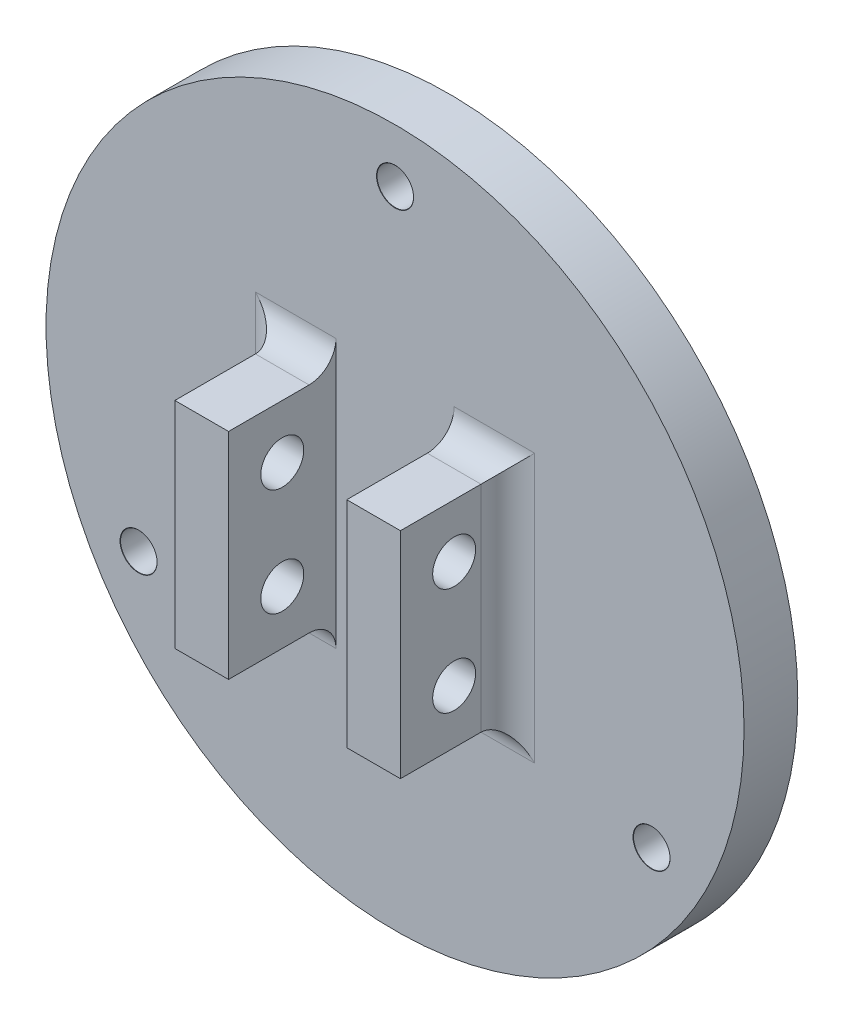
ISO-10303-21;
HEADER;
FILE_DESCRIPTION(('STEP AP214'),'2;1');
FILE_NAME('part.step','',(''),(''),'','','');
FILE_SCHEMA(('AUTOMOTIVE_DESIGN { 1 0 10303 214 1 1 1 1 }'));
ENDSEC;
DATA;
#1=APPLICATION_CONTEXT('core data for automotive mechanical design processes');
#2=APPLICATION_PROTOCOL_DEFINITION('international standard','automotive_design',2000,#1);
#3=PRODUCT_CONTEXT('',#1,'mechanical');
#4=PRODUCT('Part','Part','',(#3));
#5=PRODUCT_RELATED_PRODUCT_CATEGORY('part','',(#4));
#6=PRODUCT_DEFINITION_FORMATION('','',#4);
#7=PRODUCT_DEFINITION_CONTEXT('part definition',#1,'design');
#8=PRODUCT_DEFINITION('design','',#6,#7);
#9=PRODUCT_DEFINITION_SHAPE('','',#8);
#10=(LENGTH_UNIT() NAMED_UNIT(*) SI_UNIT(.MILLI.,.METRE.));
#11=(NAMED_UNIT(*) PLANE_ANGLE_UNIT() SI_UNIT($,.RADIAN.));
#12=(NAMED_UNIT(*) SI_UNIT($,.STERADIAN.) SOLID_ANGLE_UNIT());
#13=UNCERTAINTY_MEASURE_WITH_UNIT(LENGTH_MEASURE(1.E-05),#10,'distance_accuracy_value','');
#14=(GEOMETRIC_REPRESENTATION_CONTEXT(3) GLOBAL_UNCERTAINTY_ASSIGNED_CONTEXT((#13)) GLOBAL_UNIT_ASSIGNED_CONTEXT((#10,
#11,#12)) REPRESENTATION_CONTEXT('',''));
#15=CARTESIAN_POINT('',(0.,0.,0.));
#16=DIRECTION('',(0.,0.,1.));
#17=DIRECTION('',(1.,0.,0.));
#18=AXIS2_PLACEMENT_3D('',#15,#16,#17);
#19=CARTESIAN_POINT('',(0.,0.,5.));
#20=DIRECTION('',(0.,0.,1.));
#21=DIRECTION('',(1.,0.,0.));
#22=AXIS2_PLACEMENT_3D('',#19,#20,#21);
#23=PLANE('',#22);
#24=CARTESIAN_POINT('',(0.,0.,5.));
#25=DIRECTION('',(0.,0.,1.));
#26=DIRECTION('',(1.,0.,0.));
#27=AXIS2_PLACEMENT_3D('',#24,#25,#26);
#28=CIRCLE('',#27,1.7);
#29=CARTESIAN_POINT('',(1.7,0.,5.));
#30=VERTEX_POINT('',#29);
#31=EDGE_CURVE('E211',#30,#30,#28,.T.);
#32=ORIENTED_EDGE('',*,*,#31,.F.);
#33=EDGE_LOOP('',(#32));
#34=FACE_BOUND('',#33,.T.);
#35=CARTESIAN_POINT('',(23.8829807765439,-13.8665361411643,5.));
#36=DIRECTION('',(0.,0.,1.));
#37=DIRECTION('',(1.,0.,0.));
#38=AXIS2_PLACEMENT_3D('',#35,#36,#37);
#39=CIRCLE('',#38,1.725);
#40=CARTESIAN_POINT('',(25.6079807765439,-13.8665361411643,5.));
#41=VERTEX_POINT('',#40);
#42=EDGE_CURVE('E178',#41,#41,#39,.T.);
#43=ORIENTED_EDGE('',*,*,#42,.F.);
#44=EDGE_LOOP('',(#43));
#45=FACE_BOUND('',#44,.T.);
#46=CARTESIAN_POINT('',(-23.8829807765437,-13.8665361411647,5.));
#47=DIRECTION('',(0.,0.,1.));
#48=DIRECTION('',(1.,0.,0.));
#49=AXIS2_PLACEMENT_3D('',#46,#47,#48);
#50=CIRCLE('',#49,1.725);
#51=CARTESIAN_POINT('',(-22.1579807765437,-13.8665361411647,5.));
#52=VERTEX_POINT('',#51);
#53=EDGE_CURVE('E187',#52,#52,#50,.T.);
#54=ORIENTED_EDGE('',*,*,#53,.F.);
#55=EDGE_LOOP('',(#54));
#56=FACE_BOUND('',#55,.T.);
#57=CARTESIAN_POINT('',(0.,27.5,5.));
#58=DIRECTION('',(0.,0.,1.));
#59=DIRECTION('',(1.,0.,0.));
#60=AXIS2_PLACEMENT_3D('',#57,#58,#59);
#61=CIRCLE('',#60,1.725);
#62=CARTESIAN_POINT('',(1.725,27.5,5.));
#63=VERTEX_POINT('',#62);
#64=EDGE_CURVE('E196',#63,#63,#61,.T.);
#65=ORIENTED_EDGE('',*,*,#64,.F.);
#66=EDGE_LOOP('',(#65));
#67=FACE_BOUND('',#66,.T.);
#68=CARTESIAN_POINT('',(0.,0.,5.));
#69=DIRECTION('',(0.,0.,1.));
#70=DIRECTION('',(1.,0.,0.));
#71=AXIS2_PLACEMENT_3D('',#68,#69,#70);
#72=CIRCLE('',#71,32.5);
#73=CARTESIAN_POINT('',(32.5,0.,5.));
#74=VERTEX_POINT('',#73);
#75=EDGE_CURVE('E206',#74,#74,#72,.T.);
#76=ORIENTED_EDGE('',*,*,#75,.T.);
#77=EDGE_LOOP('',(#76));
#78=FACE_BOUND('',#77,.T.);
#79=DIRECTION('',(0.,1.,0.));
#80=VECTOR('',#79,1.);
#81=CARTESIAN_POINT('',(-5.50332787435963,-10.,5.));
#82=LINE('',#81,#80);
#83=CARTESIAN_POINT('',(-5.50332787435963,-12.5,5.));
#84=VERTEX_POINT('',#83);
#85=CARTESIAN_POINT('',(-5.50332787435963,12.5,5.));
#86=VERTEX_POINT('',#85);
#87=EDGE_CURVE('E151',#84,#86,#82,.T.);
#88=ORIENTED_EDGE('',*,*,#87,.F.);
#89=DIRECTION('',(1.,0.,0.));
#90=VECTOR('',#89,1.);
#91=CARTESIAN_POINT('',(0.,-12.5,5.));
#92=LINE('',#91,#90);
#93=CARTESIAN_POINT('',(-13.0033278743596,-12.5,5.));
#94=VERTEX_POINT('',#93);
#95=EDGE_CURVE('E242',#84,#94,#92,.F.);
#96=ORIENTED_EDGE('',*,*,#95,.T.);
#97=DIRECTION('',(0.,-1.,0.));
#98=VECTOR('',#97,1.);
#99=CARTESIAN_POINT('',(-13.0033278743596,0.,5.));
#100=LINE('',#99,#98);
#101=CARTESIAN_POINT('',(-13.0033278743596,12.5,5.));
#102=VERTEX_POINT('',#101);
#103=EDGE_CURVE('E226',#94,#102,#100,.F.);
#104=ORIENTED_EDGE('',*,*,#103,.T.);
#105=DIRECTION('',(-1.,0.,0.));
#106=VECTOR('',#105,1.);
#107=CARTESIAN_POINT('',(0.,12.5,5.));
#108=LINE('',#107,#106);
#109=EDGE_CURVE('E236',#102,#86,#108,.F.);
#110=ORIENTED_EDGE('',*,*,#109,.T.);
#111=EDGE_LOOP('',(#88,#96,#104,#110));
#112=FACE_BOUND('',#111,.T.);
#113=DIRECTION('',(0.,1.,0.));
#114=VECTOR('',#113,1.);
#115=CARTESIAN_POINT('',(13.0033278743596,0.,5.));
#116=LINE('',#115,#114);
#117=CARTESIAN_POINT('',(13.0033278743596,12.5,5.));
#118=VERTEX_POINT('',#117);
#119=CARTESIAN_POINT('',(13.0033278743596,-12.5,5.));
#120=VERTEX_POINT('',#119);
#121=EDGE_CURVE('E228',#118,#120,#116,.F.);
#122=ORIENTED_EDGE('',*,*,#121,.T.);
#123=DIRECTION('',(1.,0.,0.));
#124=VECTOR('',#123,1.);
#125=CARTESIAN_POINT('',(0.,-12.5,5.));
#126=LINE('',#125,#124);
#127=CARTESIAN_POINT('',(5.50332787435963,-12.5,5.));
#128=VERTEX_POINT('',#127);
#129=EDGE_CURVE('E245',#120,#128,#126,.F.);
#130=ORIENTED_EDGE('',*,*,#129,.T.);
#131=DIRECTION('',(0.,-1.,0.));
#132=VECTOR('',#131,1.);
#133=CARTESIAN_POINT('',(5.50332787435963,-10.,5.));
#134=LINE('',#133,#132);
#135=CARTESIAN_POINT('',(5.50332787435963,12.5,5.));
#136=VERTEX_POINT('',#135);
#137=EDGE_CURVE('E145',#136,#128,#134,.T.);
#138=ORIENTED_EDGE('',*,*,#137,.F.);
#139=DIRECTION('',(-1.,0.,0.));
#140=VECTOR('',#139,1.);
#141=CARTESIAN_POINT('',(0.,12.5,5.));
#142=LINE('',#141,#140);
#143=EDGE_CURVE('E239',#136,#118,#142,.F.);
#144=ORIENTED_EDGE('',*,*,#143,.T.);
#145=EDGE_LOOP('',(#122,#130,#138,#144));
#146=FACE_BOUND('',#145,.T.);
#147=ADVANCED_FACE('F36',(#34,#45,#56,#67,#78,#112,#146),#23,.T.);
#148=CARTESIAN_POINT('',(0.,0.,5.));
#149=DIRECTION('',(0.,0.,-1.));
#150=DIRECTION('',(-1.,0.,0.));
#151=AXIS2_PLACEMENT_3D('',#148,#149,#150);
#152=CYLINDRICAL_SURFACE('',#151,32.5);
#153=ORIENTED_EDGE('',*,*,#75,.F.);
#154=EDGE_LOOP('',(#153));
#155=FACE_BOUND('',#154,.T.);
#156=CARTESIAN_POINT('',(0.,0.,0.));
#157=DIRECTION('',(0.,0.,1.));
#158=DIRECTION('',(1.,0.,0.));
#159=AXIS2_PLACEMENT_3D('',#156,#157,#158);
#160=CIRCLE('',#159,32.5);
#161=CARTESIAN_POINT('',(32.5,0.,0.));
#162=VERTEX_POINT('',#161);
#163=EDGE_CURVE('E205',#162,#162,#160,.T.);
#164=ORIENTED_EDGE('',*,*,#163,.T.);
#165=EDGE_LOOP('',(#164));
#166=FACE_BOUND('',#165,.T.);
#167=ADVANCED_FACE('F309',(#155,#166),#152,.T.);
#168=CARTESIAN_POINT('',(0.,0.,0.));
#169=DIRECTION('',(0.,0.,1.));
#170=DIRECTION('',(1.,0.,0.));
#171=AXIS2_PLACEMENT_3D('',#168,#169,#170);
#172=PLANE('',#171);
#173=CARTESIAN_POINT('',(0.,0.,0.));
#174=DIRECTION('',(0.,0.,-1.));
#175=DIRECTION('',(-1.,0.,0.));
#176=AXIS2_PLACEMENT_3D('',#173,#174,#175);
#177=CIRCLE('',#176,3.25);
#178=CARTESIAN_POINT('',(-3.25,0.,0.));
#179=VERTEX_POINT('',#178);
#180=EDGE_CURVE('E607',#179,#179,#177,.T.);
#181=ORIENTED_EDGE('',*,*,#180,.F.);
#182=EDGE_LOOP('',(#181));
#183=FACE_BOUND('',#182,.T.);
#184=CARTESIAN_POINT('',(23.8829807765439,-13.8665361411643,0.));
#185=DIRECTION('',(0.,0.,1.));
#186=DIRECTION('',(1.,0.,0.));
#187=AXIS2_PLACEMENT_3D('',#184,#185,#186);
#188=CIRCLE('',#187,1.7);
#189=CARTESIAN_POINT('',(25.5829807765439,-13.8665361411643,0.));
#190=VERTEX_POINT('',#189);
#191=EDGE_CURVE('E184',#190,#190,#188,.T.);
#192=ORIENTED_EDGE('',*,*,#191,.T.);
#193=EDGE_LOOP('',(#192));
#194=FACE_BOUND('',#193,.T.);
#195=CARTESIAN_POINT('',(-23.8829807765437,-13.8665361411647,0.));
#196=DIRECTION('',(0.,0.,1.));
#197=DIRECTION('',(1.,0.,0.));
#198=AXIS2_PLACEMENT_3D('',#195,#196,#197);
#199=CIRCLE('',#198,1.7);
#200=CARTESIAN_POINT('',(-22.1829807765437,-13.8665361411647,0.));
#201=VERTEX_POINT('',#200);
#202=EDGE_CURVE('E193',#201,#201,#199,.T.);
#203=ORIENTED_EDGE('',*,*,#202,.T.);
#204=EDGE_LOOP('',(#203));
#205=FACE_BOUND('',#204,.T.);
#206=CARTESIAN_POINT('',(0.,27.5,0.));
#207=DIRECTION('',(0.,0.,1.));
#208=DIRECTION('',(1.,0.,0.));
#209=AXIS2_PLACEMENT_3D('',#206,#207,#208);
#210=CIRCLE('',#209,1.7);
#211=CARTESIAN_POINT('',(1.7,27.5,0.));
#212=VERTEX_POINT('',#211);
#213=EDGE_CURVE('E202',#212,#212,#210,.T.);
#214=ORIENTED_EDGE('',*,*,#213,.T.);
#215=EDGE_LOOP('',(#214));
#216=FACE_BOUND('',#215,.T.);
#217=ORIENTED_EDGE('',*,*,#163,.F.);
#218=EDGE_LOOP('',(#217));
#219=FACE_BOUND('',#218,.T.);
#220=ADVANCED_FACE('F315',(#183,#194,#205,#216,#219),#172,.F.);
#221=CARTESIAN_POINT('',(0.,27.5,5.));
#222=DIRECTION('',(0.,0.,1.));
#223=DIRECTION('',(1.,0.,0.));
#224=AXIS2_PLACEMENT_3D('',#221,#222,#223);
#225=CYLINDRICAL_SURFACE('',#224,1.7);
#226=ORIENTED_EDGE('',*,*,#213,.F.);
#227=EDGE_LOOP('',(#226));
#228=FACE_BOUND('',#227,.T.);
#229=CARTESIAN_POINT('',(0.,27.5,4.97902250922057));
#230=DIRECTION('',(0.,0.,1.));
#231=DIRECTION('',(1.,0.,0.));
#232=AXIS2_PLACEMENT_3D('',#229,#230,#231);
#233=CIRCLE('',#232,1.7);
#234=CARTESIAN_POINT('',(1.7,27.5,4.97902250922057));
#235=VERTEX_POINT('',#234);
#236=EDGE_CURVE('E199',#235,#235,#233,.T.);
#237=ORIENTED_EDGE('',*,*,#236,.T.);
#238=EDGE_LOOP('',(#237));
#239=FACE_BOUND('',#238,.T.);
#240=ADVANCED_FACE('F322',(#228,#239),#225,.F.);
#241=CARTESIAN_POINT('',(0.,27.5,5.));
#242=DIRECTION('',(0.,0.,1.));
#243=DIRECTION('',(1.,0.,0.));
#244=AXIS2_PLACEMENT_3D('',#241,#242,#243);
#245=CONICAL_SURFACE('',#244,1.725,0.872664625997142);
#246=ORIENTED_EDGE('',*,*,#236,.F.);
#247=EDGE_LOOP('',(#246));
#248=FACE_BOUND('',#247,.T.);
#249=ORIENTED_EDGE('',*,*,#64,.T.);
#250=EDGE_LOOP('',(#249));
#251=FACE_BOUND('',#250,.T.);
#252=ADVANCED_FACE('F507',(#248,#251),#245,.F.);
#253=CARTESIAN_POINT('',(-23.8829807765437,-13.8665361411647,5.));
#254=DIRECTION('',(0.,0.,1.));
#255=DIRECTION('',(1.,0.,0.));
#256=AXIS2_PLACEMENT_3D('',#253,#254,#255);
#257=CYLINDRICAL_SURFACE('',#256,1.7);
#258=ORIENTED_EDGE('',*,*,#202,.F.);
#259=EDGE_LOOP('',(#258));
#260=FACE_BOUND('',#259,.T.);
#261=CARTESIAN_POINT('',(-23.8829807765437,-13.8665361411647,4.97902250922057));
#262=DIRECTION('',(0.,0.,1.));
#263=DIRECTION('',(1.,0.,0.));
#264=AXIS2_PLACEMENT_3D('',#261,#262,#263);
#265=CIRCLE('',#264,1.7);
#266=CARTESIAN_POINT('',(-22.1829807765437,-13.8665361411647,4.97902250922057));
#267=VERTEX_POINT('',#266);
#268=EDGE_CURVE('E190',#267,#267,#265,.T.);
#269=ORIENTED_EDGE('',*,*,#268,.T.);
#270=EDGE_LOOP('',(#269));
#271=FACE_BOUND('',#270,.T.);
#272=ADVANCED_FACE('F513',(#260,#271),#257,.F.);
#273=CARTESIAN_POINT('',(-23.8829807765437,-13.8665361411647,5.));
#274=DIRECTION('',(0.,0.,1.));
#275=DIRECTION('',(1.,0.,0.));
#276=AXIS2_PLACEMENT_3D('',#273,#274,#275);
#277=CONICAL_SURFACE('',#276,1.725,0.872664625997138);
#278=ORIENTED_EDGE('',*,*,#268,.F.);
#279=EDGE_LOOP('',(#278));
#280=FACE_BOUND('',#279,.T.);
#281=ORIENTED_EDGE('',*,*,#53,.T.);
#282=EDGE_LOOP('',(#281));
#283=FACE_BOUND('',#282,.T.);
#284=ADVANCED_FACE('F520',(#280,#283),#277,.F.);
#285=CARTESIAN_POINT('',(23.8829807765439,-13.8665361411643,5.));
#286=DIRECTION('',(0.,0.,1.));
#287=DIRECTION('',(1.,0.,0.));
#288=AXIS2_PLACEMENT_3D('',#285,#286,#287);
#289=CYLINDRICAL_SURFACE('',#288,1.7);
#290=ORIENTED_EDGE('',*,*,#191,.F.);
#291=EDGE_LOOP('',(#290));
#292=FACE_BOUND('',#291,.T.);
#293=CARTESIAN_POINT('',(23.8829807765439,-13.8665361411643,4.97902250922057));
#294=DIRECTION('',(0.,0.,1.));
#295=DIRECTION('',(1.,0.,0.));
#296=AXIS2_PLACEMENT_3D('',#293,#294,#295);
#297=CIRCLE('',#296,1.7);
#298=CARTESIAN_POINT('',(25.5829807765439,-13.8665361411643,4.97902250922057));
#299=VERTEX_POINT('',#298);
#300=EDGE_CURVE('E181',#299,#299,#297,.T.);
#301=ORIENTED_EDGE('',*,*,#300,.T.);
#302=EDGE_LOOP('',(#301));
#303=FACE_BOUND('',#302,.T.);
#304=ADVANCED_FACE('F528',(#292,#303),#289,.F.);
#305=CARTESIAN_POINT('',(23.8829807765439,-13.8665361411643,5.));
#306=DIRECTION('',(0.,0.,1.));
#307=DIRECTION('',(1.,0.,0.));
#308=AXIS2_PLACEMENT_3D('',#305,#306,#307);
#309=CONICAL_SURFACE('',#308,1.725,0.872664625997138);
#310=ORIENTED_EDGE('',*,*,#300,.F.);
#311=EDGE_LOOP('',(#310));
#312=FACE_BOUND('',#311,.T.);
#313=ORIENTED_EDGE('',*,*,#42,.T.);
#314=EDGE_LOOP('',(#313));
#315=FACE_BOUND('',#314,.T.);
#316=ADVANCED_FACE('F536',(#312,#315),#309,.F.);
#317=CARTESIAN_POINT('',(-10.5033278743596,-10.,15.));
#318=DIRECTION('',(1.,0.,0.));
#319=DIRECTION('',(0.,0.,-1.));
#320=AXIS2_PLACEMENT_3D('',#317,#318,#319);
#321=PLANE('',#320);
#322=CARTESIAN_POINT('',(-10.5033278743596,5.,10.));
#323=DIRECTION('',(-1.,0.,0.));
#324=DIRECTION('',(0.,0.,1.));
#325=AXIS2_PLACEMENT_3D('',#322,#323,#324);
#326=CIRCLE('',#325,1.99999999999999);
#327=CARTESIAN_POINT('',(-10.5033278743596,5.,12.));
#328=VERTEX_POINT('',#327);
#329=EDGE_CURVE('E224',#328,#328,#326,.T.);
#330=ORIENTED_EDGE('',*,*,#329,.F.);
#331=EDGE_LOOP('',(#330));
#332=FACE_BOUND('',#331,.T.);
#333=CARTESIAN_POINT('',(-10.5033278743596,-5.,10.));
#334=DIRECTION('',(-1.,0.,0.));
#335=DIRECTION('',(0.,0.,1.));
#336=AXIS2_PLACEMENT_3D('',#333,#334,#335);
#337=CIRCLE('',#336,1.99999999999999);
#338=CARTESIAN_POINT('',(-10.5033278743596,-5.,12.));
#339=VERTEX_POINT('',#338);
#340=EDGE_CURVE('E219',#339,#339,#337,.T.);
#341=ORIENTED_EDGE('',*,*,#340,.F.);
#342=EDGE_LOOP('',(#341));
#343=FACE_BOUND('',#342,.T.);
#344=DIRECTION('',(0.,0.,-1.));
#345=VECTOR('',#344,1.);
#346=CARTESIAN_POINT('',(-10.5033278743596,10.,15.));
#347=LINE('',#346,#345);
#348=CARTESIAN_POINT('',(-10.5033278743596,10.,15.));
#349=VERTEX_POINT('',#348);
#350=CARTESIAN_POINT('',(-10.5033278743596,10.,7.5));
#351=VERTEX_POINT('',#350);
#352=EDGE_CURVE('E166',#349,#351,#347,.T.);
#353=ORIENTED_EDGE('',*,*,#352,.T.);
#354=DIRECTION('',(0.,-1.,0.));
#355=VECTOR('',#354,1.);
#356=CARTESIAN_POINT('',(-10.5033278743596,-10.,7.5));
#357=LINE('',#356,#355);
#358=CARTESIAN_POINT('',(-10.5033278743596,-10.,7.5));
#359=VERTEX_POINT('',#358);
#360=EDGE_CURVE('E230',#351,#359,#357,.T.);
#361=ORIENTED_EDGE('',*,*,#360,.T.);
#362=DIRECTION('',(0.,0.,-1.));
#363=VECTOR('',#362,1.);
#364=CARTESIAN_POINT('',(-10.5033278743596,-10.,15.));
#365=LINE('',#364,#363);
#366=CARTESIAN_POINT('',(-10.5033278743596,-10.,15.));
#367=VERTEX_POINT('',#366);
#368=EDGE_CURVE('E175',#367,#359,#365,.T.);
#369=ORIENTED_EDGE('',*,*,#368,.F.);
#370=DIRECTION('',(0.,-1.,0.));
#371=VECTOR('',#370,1.);
#372=CARTESIAN_POINT('',(-10.5033278743596,-10.,15.));
#373=LINE('',#372,#371);
#374=EDGE_CURVE('E153',#349,#367,#373,.T.);
#375=ORIENTED_EDGE('',*,*,#374,.F.);
#376=EDGE_LOOP('',(#353,#361,#369,#375));
#377=FACE_BOUND('',#376,.T.);
#378=ADVANCED_FACE('F284',(#332,#343,#377),#321,.F.);
#379=CARTESIAN_POINT('',(-10.5033278743596,-10.,15.));
#380=DIRECTION('',(0.,1.,0.));
#381=DIRECTION('',(0.,0.,1.));
#382=AXIS2_PLACEMENT_3D('',#379,#380,#381);
#383=PLANE('',#382);
#384=ORIENTED_EDGE('',*,*,#368,.T.);
#385=DIRECTION('',(1.,0.,0.));
#386=VECTOR('',#385,1.);
#387=CARTESIAN_POINT('',(-10.5033278743596,-10.,7.5));
#388=LINE('',#387,#386);
#389=CARTESIAN_POINT('',(-5.50332787435963,-10.,7.5));
#390=VERTEX_POINT('',#389);
#391=EDGE_CURVE('E248',#359,#390,#388,.T.);
#392=ORIENTED_EDGE('',*,*,#391,.T.);
#393=DIRECTION('',(0.,0.,-1.));
#394=VECTOR('',#393,1.);
#395=CARTESIAN_POINT('',(-5.50332787435963,-10.,15.));
#396=LINE('',#395,#394);
#397=CARTESIAN_POINT('',(-5.50332787435963,-10.,15.));
#398=VERTEX_POINT('',#397);
#399=EDGE_CURVE('E172',#398,#390,#396,.T.);
#400=ORIENTED_EDGE('',*,*,#399,.F.);
#401=DIRECTION('',(1.,0.,0.));
#402=VECTOR('',#401,1.);
#403=CARTESIAN_POINT('',(-10.5033278743596,-10.,15.));
#404=LINE('',#403,#402);
#405=EDGE_CURVE('E161',#367,#398,#404,.T.);
#406=ORIENTED_EDGE('',*,*,#405,.F.);
#407=EDGE_LOOP('',(#384,#392,#400,#406));
#408=FACE_BOUND('',#407,.T.);
#409=ADVANCED_FACE('F288',(#408),#383,.F.);
#410=CARTESIAN_POINT('',(-5.50332787435963,-10.,15.));
#411=DIRECTION('',(-1.,0.,0.));
#412=DIRECTION('',(0.,0.,1.));
#413=AXIS2_PLACEMENT_3D('',#410,#411,#412);
#414=PLANE('',#413);
#415=CARTESIAN_POINT('',(-5.50332787435963,5.,10.));
#416=DIRECTION('',(-1.,0.,0.));
#417=DIRECTION('',(0.,0.,1.));
#418=AXIS2_PLACEMENT_3D('',#415,#416,#417);
#419=CIRCLE('',#418,1.99999999999999);
#420=CARTESIAN_POINT('',(-5.50332787435963,5.,12.));
#421=VERTEX_POINT('',#420);
#422=EDGE_CURVE('E223',#421,#421,#419,.T.);
#423=ORIENTED_EDGE('',*,*,#422,.T.);
#424=EDGE_LOOP('',(#423));
#425=FACE_BOUND('',#424,.T.);
#426=CARTESIAN_POINT('',(-5.50332787435963,-5.,10.));
#427=DIRECTION('',(-1.,0.,0.));
#428=DIRECTION('',(0.,0.,1.));
#429=AXIS2_PLACEMENT_3D('',#426,#427,#428);
#430=CIRCLE('',#429,1.99999999999999);
#431=CARTESIAN_POINT('',(-5.50332787435963,-5.,12.));
#432=VERTEX_POINT('',#431);
#433=EDGE_CURVE('E604',#432,#432,#430,.T.);
#434=ORIENTED_EDGE('',*,*,#433,.T.);
#435=EDGE_LOOP('',(#434));
#436=FACE_BOUND('',#435,.T.);
#437=ORIENTED_EDGE('',*,*,#87,.T.);
#438=CARTESIAN_POINT('',(-5.50332787435963,12.5,7.5));
#439=DIRECTION('',(-1.,0.,0.));
#440=DIRECTION('',(0.,0.,1.));
#441=AXIS2_PLACEMENT_3D('',#438,#439,#440);
#442=CIRCLE('',#441,2.5);
#443=CARTESIAN_POINT('',(-5.50332787435963,10.,7.5));
#444=VERTEX_POINT('',#443);
#445=EDGE_CURVE('E11',#86,#444,#442,.T.);
#446=ORIENTED_EDGE('',*,*,#445,.T.);
#447=DIRECTION('',(0.,0.,-1.));
#448=VECTOR('',#447,1.);
#449=CARTESIAN_POINT('',(-5.50332787435963,10.,15.));
#450=LINE('',#449,#448);
#451=CARTESIAN_POINT('',(-5.50332787435963,10.,15.));
#452=VERTEX_POINT('',#451);
#453=EDGE_CURVE('E170',#452,#444,#450,.T.);
#454=ORIENTED_EDGE('',*,*,#453,.F.);
#455=DIRECTION('',(0.,1.,0.));
#456=VECTOR('',#455,1.);
#457=CARTESIAN_POINT('',(-5.50332787435963,-10.,15.));
#458=LINE('',#457,#456);
#459=EDGE_CURVE('E163',#398,#452,#458,.T.);
#460=ORIENTED_EDGE('',*,*,#459,.F.);
#461=ORIENTED_EDGE('',*,*,#399,.T.);
#462=CARTESIAN_POINT('',(-5.50332787435963,-12.5,7.5));
#463=DIRECTION('',(-1.,0.,0.));
#464=DIRECTION('',(0.,0.,1.));
#465=AXIS2_PLACEMENT_3D('',#462,#463,#464);
#466=CIRCLE('',#465,2.5);
#467=EDGE_CURVE('E261',#390,#84,#466,.T.);
#468=ORIENTED_EDGE('',*,*,#467,.T.);
#469=EDGE_LOOP('',(#437,#446,#454,#460,#461,#468));
#470=FACE_BOUND('',#469,.T.);
#471=ADVANCED_FACE('F296',(#425,#436,#470),#414,.F.);
#472=CARTESIAN_POINT('',(-10.5033278743596,10.,15.));
#473=DIRECTION('',(0.,-1.,0.));
#474=DIRECTION('',(0.,0.,-1.));
#475=AXIS2_PLACEMENT_3D('',#472,#473,#474);
#476=PLANE('',#475);
#477=ORIENTED_EDGE('',*,*,#453,.T.);
#478=DIRECTION('',(-1.,0.,0.));
#479=VECTOR('',#478,1.);
#480=CARTESIAN_POINT('',(-10.5033278743596,10.,7.5));
#481=LINE('',#480,#479);
#482=EDGE_CURVE('E253',#444,#351,#481,.T.);
#483=ORIENTED_EDGE('',*,*,#482,.T.);
#484=ORIENTED_EDGE('',*,*,#352,.F.);
#485=DIRECTION('',(-1.,0.,0.));
#486=VECTOR('',#485,1.);
#487=CARTESIAN_POINT('',(-10.5033278743596,10.,15.));
#488=LINE('',#487,#486);
#489=EDGE_CURVE('E165',#452,#349,#488,.T.);
#490=ORIENTED_EDGE('',*,*,#489,.F.);
#491=EDGE_LOOP('',(#477,#483,#484,#490));
#492=FACE_BOUND('',#491,.T.);
#493=ADVANCED_FACE('F295',(#492),#476,.F.);
#494=CARTESIAN_POINT('',(0.,0.,15.));
#495=DIRECTION('',(0.,0.,-1.));
#496=DIRECTION('',(-1.,0.,0.));
#497=AXIS2_PLACEMENT_3D('',#494,#495,#496);
#498=PLANE('',#497);
#499=ORIENTED_EDGE('',*,*,#374,.T.);
#500=ORIENTED_EDGE('',*,*,#405,.T.);
#501=ORIENTED_EDGE('',*,*,#459,.T.);
#502=ORIENTED_EDGE('',*,*,#489,.T.);
#503=EDGE_LOOP('',(#499,#500,#501,#502));
#504=FACE_BOUND('',#503,.T.);
#505=ADVANCED_FACE('F292',(#504),#498,.F.);
#506=CARTESIAN_POINT('',(10.5033278743596,-10.,15.));
#507=DIRECTION('',(-1.,0.,0.));
#508=DIRECTION('',(0.,-1.,0.));
#509=AXIS2_PLACEMENT_3D('',#506,#507,#508);
#510=PLANE('',#509);
#511=CARTESIAN_POINT('',(10.5033278743596,5.,10.));
#512=DIRECTION('',(-1.,0.,0.));
#513=DIRECTION('',(0.,-1.,0.));
#514=AXIS2_PLACEMENT_3D('',#511,#512,#513);
#515=CIRCLE('',#514,1.99999999999999);
#516=CARTESIAN_POINT('',(10.5033278743596,3.00000000000001,10.));
#517=VERTEX_POINT('',#516);
#518=EDGE_CURVE('E596',#517,#517,#515,.T.);
#519=ORIENTED_EDGE('',*,*,#518,.T.);
#520=EDGE_LOOP('',(#519));
#521=FACE_BOUND('',#520,.T.);
#522=CARTESIAN_POINT('',(10.5033278743596,-5.,10.));
#523=DIRECTION('',(-1.,0.,0.));
#524=DIRECTION('',(0.,-1.,0.));
#525=AXIS2_PLACEMENT_3D('',#522,#523,#524);
#526=CIRCLE('',#525,1.99999999999999);
#527=CARTESIAN_POINT('',(10.5033278743596,-6.99999999999999,10.));
#528=VERTEX_POINT('',#527);
#529=EDGE_CURVE('E215',#528,#528,#526,.T.);
#530=ORIENTED_EDGE('',*,*,#529,.T.);
#531=EDGE_LOOP('',(#530));
#532=FACE_BOUND('',#531,.T.);
#533=DIRECTION('',(0.,0.,-1.));
#534=VECTOR('',#533,1.);
#535=CARTESIAN_POINT('',(10.5033278743596,-10.,15.));
#536=LINE('',#535,#534);
#537=CARTESIAN_POINT('',(10.5033278743596,-10.,15.));
#538=VERTEX_POINT('',#537);
#539=CARTESIAN_POINT('',(10.5033278743596,-10.,7.5));
#540=VERTEX_POINT('',#539);
#541=EDGE_CURVE('E353',#538,#540,#536,.T.);
#542=ORIENTED_EDGE('',*,*,#541,.T.);
#543=DIRECTION('',(0.,1.,0.));
#544=VECTOR('',#543,1.);
#545=CARTESIAN_POINT('',(10.5033278743596,-10.,7.5));
#546=LINE('',#545,#544);
#547=CARTESIAN_POINT('',(10.5033278743596,10.,7.5));
#548=VERTEX_POINT('',#547);
#549=EDGE_CURVE('E150',#540,#548,#546,.T.);
#550=ORIENTED_EDGE('',*,*,#549,.T.);
#551=DIRECTION('',(0.,0.,-1.));
#552=VECTOR('',#551,1.);
#553=CARTESIAN_POINT('',(10.5033278743596,10.,15.));
#554=LINE('',#553,#552);
#555=CARTESIAN_POINT('',(10.5033278743596,10.,15.));
#556=VERTEX_POINT('',#555);
#557=EDGE_CURVE('E130',#556,#548,#554,.T.);
#558=ORIENTED_EDGE('',*,*,#557,.F.);
#559=DIRECTION('',(0.,1.,0.));
#560=VECTOR('',#559,1.);
#561=CARTESIAN_POINT('',(10.5033278743596,-10.,15.));
#562=LINE('',#561,#560);
#563=EDGE_CURVE('E136',#538,#556,#562,.T.);
#564=ORIENTED_EDGE('',*,*,#563,.F.);
#565=EDGE_LOOP('',(#542,#550,#558,#564));
#566=FACE_BOUND('',#565,.T.);
#567=ADVANCED_FACE('F148',(#521,#532,#566),#510,.F.);
#568=CARTESIAN_POINT('',(10.5033278743596,10.,15.));
#569=DIRECTION('',(0.,-1.,0.));
#570=DIRECTION('',(0.,0.,-1.));
#571=AXIS2_PLACEMENT_3D('',#568,#569,#570);
#572=PLANE('',#571);
#573=ORIENTED_EDGE('',*,*,#557,.T.);
#574=DIRECTION('',(-1.,0.,0.));
#575=VECTOR('',#574,1.);
#576=CARTESIAN_POINT('',(10.5033278743596,10.,7.5));
#577=LINE('',#576,#575);
#578=CARTESIAN_POINT('',(5.50332787435963,10.,7.5));
#579=VERTEX_POINT('',#578);
#580=EDGE_CURVE('E251',#548,#579,#577,.T.);
#581=ORIENTED_EDGE('',*,*,#580,.T.);
#582=DIRECTION('',(0.,0.,-1.));
#583=VECTOR('',#582,1.);
#584=CARTESIAN_POINT('',(5.50332787435963,10.,15.));
#585=LINE('',#584,#583);
#586=CARTESIAN_POINT('',(5.50332787435963,10.,15.));
#587=VERTEX_POINT('',#586);
#588=EDGE_CURVE('E132',#587,#579,#585,.T.);
#589=ORIENTED_EDGE('',*,*,#588,.F.);
#590=DIRECTION('',(-1.,0.,0.));
#591=VECTOR('',#590,1.);
#592=CARTESIAN_POINT('',(10.5033278743596,10.,15.));
#593=LINE('',#592,#591);
#594=EDGE_CURVE('E126',#556,#587,#593,.T.);
#595=ORIENTED_EDGE('',*,*,#594,.F.);
#596=EDGE_LOOP('',(#573,#581,#589,#595));
#597=FACE_BOUND('',#596,.T.);
#598=ADVANCED_FACE('F128',(#597),#572,.F.);
#599=CARTESIAN_POINT('',(5.50332787435963,-10.,15.));
#600=DIRECTION('',(1.,0.,0.));
#601=DIRECTION('',(0.,1.,0.));
#602=AXIS2_PLACEMENT_3D('',#599,#600,#601);
#603=PLANE('',#602);
#604=CARTESIAN_POINT('',(5.50332787435963,5.,10.));
#605=DIRECTION('',(1.,0.,0.));
#606=DIRECTION('',(0.,1.,0.));
#607=AXIS2_PLACEMENT_3D('',#604,#605,#606);
#608=CIRCLE('',#607,1.99999999999999);
#609=CARTESIAN_POINT('',(5.50332787435963,6.99999999999999,10.));
#610=VERTEX_POINT('',#609);
#611=EDGE_CURVE('E220',#610,#610,#608,.T.);
#612=ORIENTED_EDGE('',*,*,#611,.T.);
#613=EDGE_LOOP('',(#612));
#614=FACE_BOUND('',#613,.T.);
#615=CARTESIAN_POINT('',(5.50332787435963,-5.,10.));
#616=DIRECTION('',(1.,0.,0.));
#617=DIRECTION('',(0.,1.,0.));
#618=AXIS2_PLACEMENT_3D('',#615,#616,#617);
#619=CIRCLE('',#618,1.99999999999999);
#620=CARTESIAN_POINT('',(5.50332787435963,-3.00000000000001,10.));
#621=VERTEX_POINT('',#620);
#622=EDGE_CURVE('E218',#621,#621,#619,.T.);
#623=ORIENTED_EDGE('',*,*,#622,.T.);
#624=EDGE_LOOP('',(#623));
#625=FACE_BOUND('',#624,.T.);
#626=ORIENTED_EDGE('',*,*,#137,.T.);
#627=CARTESIAN_POINT('',(5.50332787435963,-12.5,7.5));
#628=DIRECTION('',(1.,0.,0.));
#629=DIRECTION('',(0.,1.,0.));
#630=AXIS2_PLACEMENT_3D('',#627,#628,#629);
#631=CIRCLE('',#630,2.5);
#632=CARTESIAN_POINT('',(5.50332787435963,-10.,7.5));
#633=VERTEX_POINT('',#632);
#634=EDGE_CURVE('E259',#128,#633,#631,.T.);
#635=ORIENTED_EDGE('',*,*,#634,.T.);
#636=DIRECTION('',(0.,0.,-1.));
#637=VECTOR('',#636,1.);
#638=CARTESIAN_POINT('',(5.50332787435963,-10.,15.));
#639=LINE('',#638,#637);
#640=CARTESIAN_POINT('',(5.50332787435963,-10.,15.));
#641=VERTEX_POINT('',#640);
#642=EDGE_CURVE('E155',#641,#633,#639,.T.);
#643=ORIENTED_EDGE('',*,*,#642,.F.);
#644=DIRECTION('',(0.,-1.,0.));
#645=VECTOR('',#644,1.);
#646=CARTESIAN_POINT('',(5.50332787435963,-10.,15.));
#647=LINE('',#646,#645);
#648=EDGE_CURVE('E135',#587,#641,#647,.T.);
#649=ORIENTED_EDGE('',*,*,#648,.F.);
#650=ORIENTED_EDGE('',*,*,#588,.T.);
#651=CARTESIAN_POINT('',(5.50332787435963,12.5,7.5));
#652=DIRECTION('',(1.,0.,0.));
#653=DIRECTION('',(0.,1.,0.));
#654=AXIS2_PLACEMENT_3D('',#651,#652,#653);
#655=CIRCLE('',#654,2.5);
#656=EDGE_CURVE('E57',#579,#136,#655,.T.);
#657=ORIENTED_EDGE('',*,*,#656,.T.);
#658=EDGE_LOOP('',(#626,#635,#643,#649,#650,#657));
#659=FACE_BOUND('',#658,.T.);
#660=ADVANCED_FACE('F349',(#614,#625,#659),#603,.F.);
#661=CARTESIAN_POINT('',(10.5033278743596,-10.,15.));
#662=DIRECTION('',(0.,1.,0.));
#663=DIRECTION('',(0.,0.,1.));
#664=AXIS2_PLACEMENT_3D('',#661,#662,#663);
#665=PLANE('',#664);
#666=ORIENTED_EDGE('',*,*,#642,.T.);
#667=DIRECTION('',(1.,0.,0.));
#668=VECTOR('',#667,1.);
#669=CARTESIAN_POINT('',(10.5033278743596,-10.,7.5));
#670=LINE('',#669,#668);
#671=EDGE_CURVE('E233',#633,#540,#670,.T.);
#672=ORIENTED_EDGE('',*,*,#671,.T.);
#673=ORIENTED_EDGE('',*,*,#541,.F.);
#674=DIRECTION('',(1.,0.,0.));
#675=VECTOR('',#674,1.);
#676=CARTESIAN_POINT('',(10.5033278743596,-10.,15.));
#677=LINE('',#676,#675);
#678=EDGE_CURVE('E141',#641,#538,#677,.T.);
#679=ORIENTED_EDGE('',*,*,#678,.F.);
#680=EDGE_LOOP('',(#666,#672,#673,#679));
#681=FACE_BOUND('',#680,.T.);
#682=ADVANCED_FACE('F358',(#681),#665,.F.);
#683=CARTESIAN_POINT('',(0.,0.,15.));
#684=DIRECTION('',(0.,0.,1.));
#685=DIRECTION('',(1.,0.,0.));
#686=AXIS2_PLACEMENT_3D('',#683,#684,#685);
#687=PLANE('',#686);
#688=ORIENTED_EDGE('',*,*,#563,.T.);
#689=ORIENTED_EDGE('',*,*,#594,.T.);
#690=ORIENTED_EDGE('',*,*,#648,.T.);
#691=ORIENTED_EDGE('',*,*,#678,.T.);
#692=EDGE_LOOP('',(#688,#689,#690,#691));
#693=FACE_BOUND('',#692,.T.);
#694=ADVANCED_FACE('F139',(#693),#687,.T.);
#695=CARTESIAN_POINT('',(0.,0.,0.));
#696=DIRECTION('',(0.,0.,-1.));
#697=DIRECTION('',(-1.,0.,0.));
#698=AXIS2_PLACEMENT_3D('',#695,#696,#697);
#699=CYLINDRICAL_SURFACE('',#698,1.7);
#700=ORIENTED_EDGE('',*,*,#31,.T.);
#701=EDGE_LOOP('',(#700));
#702=FACE_BOUND('',#701,.T.);
#703=CARTESIAN_POINT('',(0.,0.,3.4));
#704=DIRECTION('',(0.,0.,-1.));
#705=DIRECTION('',(-1.,0.,0.));
#706=AXIS2_PLACEMENT_3D('',#703,#704,#705);
#707=CIRCLE('',#706,1.7);
#708=CARTESIAN_POINT('',(-1.7,0.,3.4));
#709=VERTEX_POINT('',#708);
#710=EDGE_CURVE('E214',#709,#709,#707,.T.);
#711=ORIENTED_EDGE('',*,*,#710,.T.);
#712=EDGE_LOOP('',(#711));
#713=FACE_BOUND('',#712,.T.);
#714=ADVANCED_FACE('F365',(#702,#713),#699,.F.);
#715=CARTESIAN_POINT('',(1.7,0.,3.4));
#716=DIRECTION('',(0.,0.,1.));
#717=DIRECTION('',(1.,0.,0.));
#718=AXIS2_PLACEMENT_3D('',#715,#716,#717);
#719=PLANE('',#718);
#720=ORIENTED_EDGE('',*,*,#710,.F.);
#721=EDGE_LOOP('',(#720));
#722=FACE_BOUND('',#721,.T.);
#723=CARTESIAN_POINT('',(0.,0.,3.4));
#724=DIRECTION('',(0.,0.,-1.));
#725=DIRECTION('',(-1.,0.,0.));
#726=AXIS2_PLACEMENT_3D('',#723,#724,#725);
#727=CIRCLE('',#726,3.25);
#728=CARTESIAN_POINT('',(-3.25,0.,3.4));
#729=VERTEX_POINT('',#728);
#730=EDGE_CURVE('E610',#729,#729,#727,.T.);
#731=ORIENTED_EDGE('',*,*,#730,.T.);
#732=EDGE_LOOP('',(#731));
#733=FACE_BOUND('',#732,.T.);
#734=ADVANCED_FACE('F472',(#722,#733),#719,.F.);
#735=CARTESIAN_POINT('',(0.,0.,0.));
#736=DIRECTION('',(0.,0.,-1.));
#737=DIRECTION('',(-1.,0.,0.));
#738=AXIS2_PLACEMENT_3D('',#735,#736,#737);
#739=CYLINDRICAL_SURFACE('',#738,3.25);
#740=ORIENTED_EDGE('',*,*,#730,.F.);
#741=EDGE_LOOP('',(#740));
#742=FACE_BOUND('',#741,.T.);
#743=ORIENTED_EDGE('',*,*,#180,.T.);
#744=EDGE_LOOP('',(#743));
#745=FACE_BOUND('',#744,.T.);
#746=ADVANCED_FACE('F465',(#742,#745),#739,.F.);
#747=CARTESIAN_POINT('',(-10.5033278743596,-5.,10.));
#748=DIRECTION('',(-1.,0.,0.));
#749=DIRECTION('',(0.,0.,1.));
#750=AXIS2_PLACEMENT_3D('',#747,#748,#749);
#751=CYLINDRICAL_SURFACE('',#750,1.99999999999999);
#752=ORIENTED_EDGE('',*,*,#529,.F.);
#753=EDGE_LOOP('',(#752));
#754=FACE_BOUND('',#753,.T.);
#755=ORIENTED_EDGE('',*,*,#622,.F.);
#756=EDGE_LOOP('',(#755));
#757=FACE_BOUND('',#756,.T.);
#758=ADVANCED_FACE('F457',(#754,#757),#751,.F.);
#759=ORIENTED_EDGE('',*,*,#340,.T.);
#760=EDGE_LOOP('',(#759));
#761=FACE_BOUND('',#760,.T.);
#762=ORIENTED_EDGE('',*,*,#433,.F.);
#763=EDGE_LOOP('',(#762));
#764=FACE_BOUND('',#763,.T.);
#765=ADVANCED_FACE('F450',(#761,#764),#751,.F.);
#766=CARTESIAN_POINT('',(-10.5033278743596,5.,10.));
#767=DIRECTION('',(-1.,0.,0.));
#768=DIRECTION('',(0.,0.,1.));
#769=AXIS2_PLACEMENT_3D('',#766,#767,#768);
#770=CYLINDRICAL_SURFACE('',#769,1.99999999999999);
#771=ORIENTED_EDGE('',*,*,#611,.F.);
#772=EDGE_LOOP('',(#771));
#773=FACE_BOUND('',#772,.T.);
#774=ORIENTED_EDGE('',*,*,#518,.F.);
#775=EDGE_LOOP('',(#774));
#776=FACE_BOUND('',#775,.T.);
#777=ADVANCED_FACE('F443',(#773,#776),#770,.F.);
#778=ORIENTED_EDGE('',*,*,#329,.T.);
#779=EDGE_LOOP('',(#778));
#780=FACE_BOUND('',#779,.T.);
#781=ORIENTED_EDGE('',*,*,#422,.F.);
#782=EDGE_LOOP('',(#781));
#783=FACE_BOUND('',#782,.T.);
#784=ADVANCED_FACE('F330',(#780,#783),#770,.F.);
#785=CARTESIAN_POINT('',(13.0033278743596,-10.,7.5));
#786=DIRECTION('',(0.,1.,0.));
#787=DIRECTION('',(-1.,0.,0.));
#788=AXIS2_PLACEMENT_3D('',#785,#786,#787);
#789=CYLINDRICAL_SURFACE('',#788,2.5);
#790=ORIENTED_EDGE('',*,*,#549,.F.);
#791=CARTESIAN_POINT('',(13.0033278743596,-12.5,7.5));
#792=DIRECTION('',(0.707106781186547,0.707106781186548,0.));
#793=DIRECTION('',(-0.707106781186548,0.707106781186547,0.));
#794=AXIS2_PLACEMENT_3D('',#791,#792,#793);
#795=ELLIPSE('',#794,3.53553390593274,2.5);
#796=EDGE_CURVE('E256',#540,#120,#795,.F.);
#797=ORIENTED_EDGE('',*,*,#796,.T.);
#798=ORIENTED_EDGE('',*,*,#121,.F.);
#799=CARTESIAN_POINT('',(13.0033278743596,12.5,7.5));
#800=DIRECTION('',(-0.707106781186548,0.707106781186547,0.));
#801=DIRECTION('',(0.707106781186547,0.707106781186548,0.));
#802=AXIS2_PLACEMENT_3D('',#799,#800,#801);
#803=ELLIPSE('',#802,3.53553390593274,2.5);
#804=EDGE_CURVE('E267',#118,#548,#803,.T.);
#805=ORIENTED_EDGE('',*,*,#804,.T.);
#806=EDGE_LOOP('',(#790,#797,#798,#805));
#807=FACE_BOUND('',#806,.T.);
#808=ADVANCED_FACE('F327',(#807),#789,.F.);
#809=CARTESIAN_POINT('',(-13.0033278743596,-10.,7.5));
#810=DIRECTION('',(0.,-1.,0.));
#811=DIRECTION('',(0.,0.,-1.));
#812=AXIS2_PLACEMENT_3D('',#809,#810,#811);
#813=CYLINDRICAL_SURFACE('',#812,2.5);
#814=ORIENTED_EDGE('',*,*,#360,.F.);
#815=CARTESIAN_POINT('',(-13.0033278743596,12.5,7.5));
#816=DIRECTION('',(-0.707106781186547,-0.707106781186547,0.));
#817=DIRECTION('',(0.707106781186547,-0.707106781186547,0.));
#818=AXIS2_PLACEMENT_3D('',#815,#816,#817);
#819=ELLIPSE('',#818,3.53553390593274,2.5);
#820=EDGE_CURVE('E44',#351,#102,#819,.F.);
#821=ORIENTED_EDGE('',*,*,#820,.T.);
#822=ORIENTED_EDGE('',*,*,#103,.F.);
#823=CARTESIAN_POINT('',(-13.0033278743596,-12.5,7.5));
#824=DIRECTION('',(0.707106781186547,-0.707106781186547,0.));
#825=DIRECTION('',(-0.707106781186547,-0.707106781186547,0.));
#826=AXIS2_PLACEMENT_3D('',#823,#824,#825);
#827=ELLIPSE('',#826,3.53553390593274,2.5);
#828=EDGE_CURVE('E264',#94,#359,#827,.T.);
#829=ORIENTED_EDGE('',*,*,#828,.T.);
#830=EDGE_LOOP('',(#814,#821,#822,#829));
#831=FACE_BOUND('',#830,.T.);
#832=ADVANCED_FACE('F272',(#831),#813,.F.);
#833=CARTESIAN_POINT('',(10.5033278743596,-12.5,7.5));
#834=DIRECTION('',(1.,0.,0.));
#835=DIRECTION('',(0.,0.,-1.));
#836=AXIS2_PLACEMENT_3D('',#833,#834,#835);
#837=CYLINDRICAL_SURFACE('',#836,2.5);
#838=ORIENTED_EDGE('',*,*,#634,.F.);
#839=ORIENTED_EDGE('',*,*,#129,.F.);
#840=ORIENTED_EDGE('',*,*,#796,.F.);
#841=ORIENTED_EDGE('',*,*,#671,.F.);
#842=EDGE_LOOP('',(#838,#839,#840,#841));
#843=FACE_BOUND('',#842,.T.);
#844=ADVANCED_FACE('F334',(#843),#837,.F.);
#845=CARTESIAN_POINT('',(-10.5033278743596,-12.5,7.5));
#846=DIRECTION('',(1.,0.,0.));
#847=DIRECTION('',(0.,0.,-1.));
#848=AXIS2_PLACEMENT_3D('',#845,#846,#847);
#849=CYLINDRICAL_SURFACE('',#848,2.5);
#850=ORIENTED_EDGE('',*,*,#828,.F.);
#851=ORIENTED_EDGE('',*,*,#95,.F.);
#852=ORIENTED_EDGE('',*,*,#467,.F.);
#853=ORIENTED_EDGE('',*,*,#391,.F.);
#854=EDGE_LOOP('',(#850,#851,#852,#853));
#855=FACE_BOUND('',#854,.T.);
#856=ADVANCED_FACE('F281',(#855),#849,.F.);
#857=CARTESIAN_POINT('',(10.5033278743596,12.5,7.5));
#858=DIRECTION('',(-1.,0.,0.));
#859=DIRECTION('',(0.,0.,1.));
#860=AXIS2_PLACEMENT_3D('',#857,#858,#859);
#861=CYLINDRICAL_SURFACE('',#860,2.5);
#862=ORIENTED_EDGE('',*,*,#804,.F.);
#863=ORIENTED_EDGE('',*,*,#143,.F.);
#864=ORIENTED_EDGE('',*,*,#656,.F.);
#865=ORIENTED_EDGE('',*,*,#580,.F.);
#866=EDGE_LOOP('',(#862,#863,#864,#865));
#867=FACE_BOUND('',#866,.T.);
#868=ADVANCED_FACE('F339',(#867),#861,.F.);
#869=CARTESIAN_POINT('',(-10.5033278743596,12.5,7.5));
#870=DIRECTION('',(-1.,0.,0.));
#871=DIRECTION('',(0.,0.,1.));
#872=AXIS2_PLACEMENT_3D('',#869,#870,#871);
#873=CYLINDRICAL_SURFACE('',#872,2.5);
#874=ORIENTED_EDGE('',*,*,#445,.F.);
#875=ORIENTED_EDGE('',*,*,#109,.F.);
#876=ORIENTED_EDGE('',*,*,#820,.F.);
#877=ORIENTED_EDGE('',*,*,#482,.F.);
#878=EDGE_LOOP('',(#874,#875,#876,#877));
#879=FACE_BOUND('',#878,.T.);
#880=ADVANCED_FACE('F38',(#879),#873,.F.);
#881=CLOSED_SHELL('',(#147,#167,#220,#240,#252,#272,#284,#304,#316,#378,#409,#471,#493,#505,
#567,#598,#660,#682,#694,#714,#734,#746,#758,#765,#777,#784,#808,#832,#844,#856,#868,#880));
#882=MANIFOLD_SOLID_BREP('B2',#881);
#883=ADVANCED_BREP_SHAPE_REPRESENTATION('',(#18,#882),#14);
#884=SHAPE_DEFINITION_REPRESENTATION(#9,#883);
ENDSEC;
END-ISO-10303-21;
